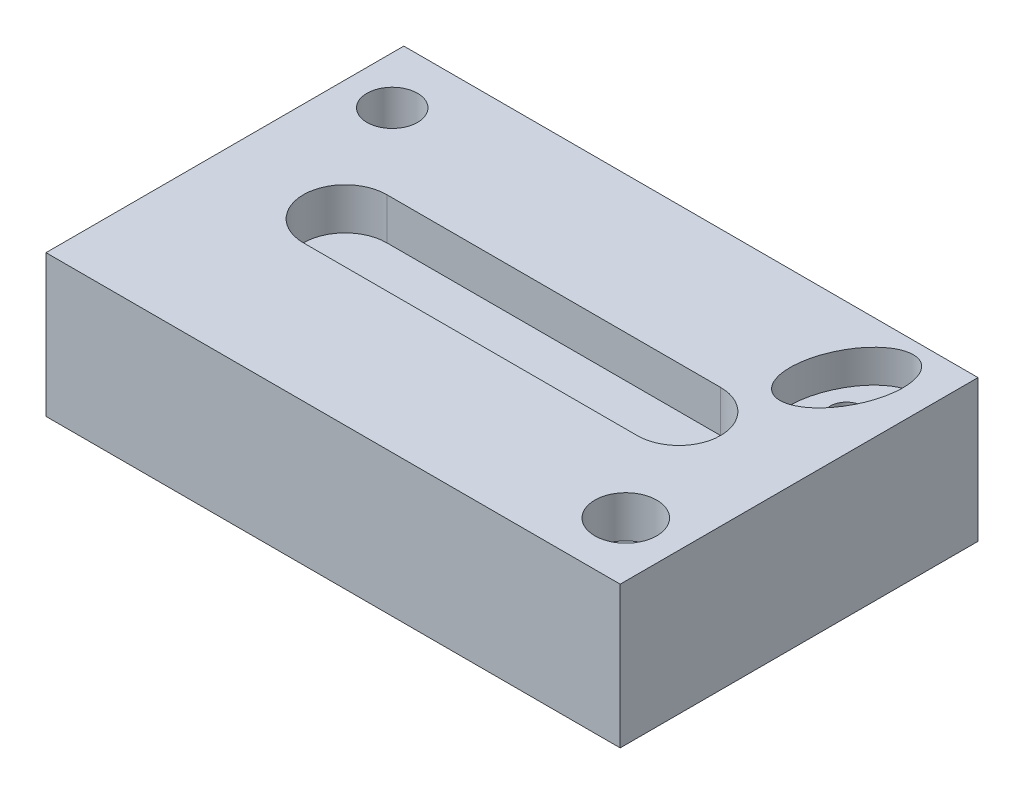
ISO-10303-21;
HEADER;
FILE_DESCRIPTION(('STEP AP214'),'2;1');
FILE_NAME('part.step','',(''),(''),'','','');
FILE_SCHEMA(('AUTOMOTIVE_DESIGN { 1 0 10303 214 1 1 1 1 }'));
ENDSEC;
DATA;
#1=APPLICATION_CONTEXT('core data for automotive mechanical design processes');
#2=APPLICATION_PROTOCOL_DEFINITION('international standard','automotive_design',2000,#1);
#3=PRODUCT_CONTEXT('',#1,'mechanical');
#4=PRODUCT('Part','Part','',(#3));
#5=PRODUCT_RELATED_PRODUCT_CATEGORY('part','',(#4));
#6=PRODUCT_DEFINITION_FORMATION('','',#4);
#7=PRODUCT_DEFINITION_CONTEXT('part definition',#1,'design');
#8=PRODUCT_DEFINITION('design','',#6,#7);
#9=PRODUCT_DEFINITION_SHAPE('','',#8);
#10=(LENGTH_UNIT() NAMED_UNIT(*) SI_UNIT(.MILLI.,.METRE.));
#11=(NAMED_UNIT(*) PLANE_ANGLE_UNIT() SI_UNIT($,.RADIAN.));
#12=(NAMED_UNIT(*) SI_UNIT($,.STERADIAN.) SOLID_ANGLE_UNIT());
#13=UNCERTAINTY_MEASURE_WITH_UNIT(LENGTH_MEASURE(1.E-05),#10,'distance_accuracy_value','');
#14=(GEOMETRIC_REPRESENTATION_CONTEXT(3) GLOBAL_UNCERTAINTY_ASSIGNED_CONTEXT((#13)) GLOBAL_UNIT_ASSIGNED_CONTEXT((#10,
#11,#12)) REPRESENTATION_CONTEXT('',''));
#15=CARTESIAN_POINT('',(0.,0.,0.));
#16=DIRECTION('',(0.,0.,1.));
#17=DIRECTION('',(1.,0.,0.));
#18=AXIS2_PLACEMENT_3D('',#15,#16,#17);
#19=CARTESIAN_POINT('',(87.39808345323,43.18,54.4636150551653));
#20=DIRECTION('',(-1.,0.,0.));
#21=DIRECTION('',(0.,0.,1.));
#22=AXIS2_PLACEMENT_3D('',#19,#20,#21);
#23=PLANE('',#22);
#24=DIRECTION('',(0.,0.,-1.));
#25=VECTOR('',#24,1.);
#26=CARTESIAN_POINT('',(87.39808345323,0.,54.4636150551653));
#27=LINE('',#26,#25);
#28=CARTESIAN_POINT('',(87.39808345323,0.,54.4636150551653));
#29=VERTEX_POINT('',#28);
#30=CARTESIAN_POINT('',(87.39808345323,0.,-54.4636150551653));
#31=VERTEX_POINT('',#30);
#32=EDGE_CURVE('E190',#29,#31,#27,.T.);
#33=ORIENTED_EDGE('',*,*,#32,.T.);
#34=DIRECTION('',(0.,-1.,0.));
#35=VECTOR('',#34,1.);
#36=CARTESIAN_POINT('',(87.39808345323,43.18,-54.4636150551653));
#37=LINE('',#36,#35);
#38=CARTESIAN_POINT('',(87.39808345323,43.18,-54.4636150551653));
#39=VERTEX_POINT('',#38);
#40=EDGE_CURVE('E12',#39,#31,#37,.T.);
#41=ORIENTED_EDGE('',*,*,#40,.F.);
#42=DIRECTION('',(0.,0.,-1.));
#43=VECTOR('',#42,1.);
#44=CARTESIAN_POINT('',(87.39808345323,43.18,54.4636150551653));
#45=LINE('',#44,#43);
#46=CARTESIAN_POINT('',(87.39808345323,43.18,54.4636150551653));
#47=VERTEX_POINT('',#46);
#48=EDGE_CURVE('E204',#47,#39,#45,.T.);
#49=ORIENTED_EDGE('',*,*,#48,.F.);
#50=DIRECTION('',(0.,-1.,0.));
#51=VECTOR('',#50,1.);
#52=CARTESIAN_POINT('',(87.39808345323,43.18,54.4636150551653));
#53=LINE('',#52,#51);
#54=EDGE_CURVE('E214',#47,#29,#53,.T.);
#55=ORIENTED_EDGE('',*,*,#54,.T.);
#56=EDGE_LOOP('',(#33,#41,#49,#55));
#57=FACE_BOUND('',#56,.T.);
#58=ADVANCED_FACE('F48',(#57),#23,.F.);
#59=CARTESIAN_POINT('',(-87.39808345323,43.18,-54.4636150551653));
#60=DIRECTION('',(0.,0.,1.));
#61=DIRECTION('',(1.,0.,0.));
#62=AXIS2_PLACEMENT_3D('',#59,#60,#61);
#63=PLANE('',#62);
#64=DIRECTION('',(-1.,0.,0.));
#65=VECTOR('',#64,1.);
#66=CARTESIAN_POINT('',(-87.39808345323,0.,-54.4636150551653));
#67=LINE('',#66,#65);
#68=CARTESIAN_POINT('',(-87.39808345323,0.,-54.4636150551653));
#69=VERTEX_POINT('',#68);
#70=EDGE_CURVE('E218',#31,#69,#67,.T.);
#71=ORIENTED_EDGE('',*,*,#70,.T.);
#72=DIRECTION('',(0.,-1.,0.));
#73=VECTOR('',#72,1.);
#74=CARTESIAN_POINT('',(-87.39808345323,43.18,-54.4636150551653));
#75=LINE('',#74,#73);
#76=CARTESIAN_POINT('',(-87.39808345323,43.18,-54.4636150551653));
#77=VERTEX_POINT('',#76);
#78=EDGE_CURVE('E56',#77,#69,#75,.T.);
#79=ORIENTED_EDGE('',*,*,#78,.F.);
#80=DIRECTION('',(-1.,0.,0.));
#81=VECTOR('',#80,1.);
#82=CARTESIAN_POINT('',(-87.39808345323,43.18,-54.4636150551653));
#83=LINE('',#82,#81);
#84=EDGE_CURVE('E100',#39,#77,#83,.T.);
#85=ORIENTED_EDGE('',*,*,#84,.F.);
#86=ORIENTED_EDGE('',*,*,#40,.T.);
#87=EDGE_LOOP('',(#71,#79,#85,#86));
#88=FACE_BOUND('',#87,.T.);
#89=ADVANCED_FACE('F253',(#88),#63,.F.);
#90=CARTESIAN_POINT('',(-87.39808345323,43.18,54.4636150551653));
#91=DIRECTION('',(1.,0.,0.));
#92=DIRECTION('',(0.,0.,-1.));
#93=AXIS2_PLACEMENT_3D('',#90,#91,#92);
#94=PLANE('',#93);
#95=DIRECTION('',(0.,0.,1.));
#96=VECTOR('',#95,1.);
#97=CARTESIAN_POINT('',(-87.39808345323,0.,54.4636150551653));
#98=LINE('',#97,#96);
#99=CARTESIAN_POINT('',(-87.39808345323,0.,54.4636150551653));
#100=VERTEX_POINT('',#99);
#101=EDGE_CURVE('E221',#69,#100,#98,.T.);
#102=ORIENTED_EDGE('',*,*,#101,.T.);
#103=DIRECTION('',(0.,-1.,0.));
#104=VECTOR('',#103,1.);
#105=CARTESIAN_POINT('',(-87.39808345323,43.18,54.4636150551653));
#106=LINE('',#105,#104);
#107=CARTESIAN_POINT('',(-87.39808345323,43.18,54.4636150551653));
#108=VERTEX_POINT('',#107);
#109=EDGE_CURVE('E228',#108,#100,#106,.T.);
#110=ORIENTED_EDGE('',*,*,#109,.F.);
#111=DIRECTION('',(0.,0.,1.));
#112=VECTOR('',#111,1.);
#113=CARTESIAN_POINT('',(-87.39808345323,43.18,54.4636150551653));
#114=LINE('',#113,#112);
#115=EDGE_CURVE('E209',#77,#108,#114,.T.);
#116=ORIENTED_EDGE('',*,*,#115,.F.);
#117=ORIENTED_EDGE('',*,*,#78,.T.);
#118=EDGE_LOOP('',(#102,#110,#116,#117));
#119=FACE_BOUND('',#118,.T.);
#120=ADVANCED_FACE('F235',(#119),#94,.F.);
#121=CARTESIAN_POINT('',(-87.39808345323,43.18,54.4636150551653));
#122=DIRECTION('',(0.,0.,-1.));
#123=DIRECTION('',(-1.,0.,0.));
#124=AXIS2_PLACEMENT_3D('',#121,#122,#123);
#125=PLANE('',#124);
#126=DIRECTION('',(1.,0.,0.));
#127=VECTOR('',#126,1.);
#128=CARTESIAN_POINT('',(-87.39808345323,0.,54.4636150551653));
#129=LINE('',#128,#127);
#130=EDGE_CURVE('E93',#100,#29,#129,.T.);
#131=ORIENTED_EDGE('',*,*,#130,.T.);
#132=ORIENTED_EDGE('',*,*,#54,.F.);
#133=DIRECTION('',(1.,0.,0.));
#134=VECTOR('',#133,1.);
#135=CARTESIAN_POINT('',(-87.39808345323,43.18,54.4636150551653));
#136=LINE('',#135,#134);
#137=EDGE_CURVE('E72',#108,#47,#136,.T.);
#138=ORIENTED_EDGE('',*,*,#137,.F.);
#139=ORIENTED_EDGE('',*,*,#109,.T.);
#140=EDGE_LOOP('',(#131,#132,#138,#139));
#141=FACE_BOUND('',#140,.T.);
#142=ADVANCED_FACE('F243',(#141),#125,.F.);
#143=CARTESIAN_POINT('',(0.,43.18,0.));
#144=DIRECTION('',(0.,-1.,0.));
#145=DIRECTION('',(0.,0.,-1.));
#146=AXIS2_PLACEMENT_3D('',#143,#144,#145);
#147=PLANE('',#146);
#148=CARTESIAN_POINT('',(67.39808345323,43.18,-34.4636150551653));
#149=DIRECTION('',(0.,1.,0.));
#150=DIRECTION('',(0.379556356256307,0.,-0.925168618374746));
#151=AXIS2_PLACEMENT_3D('',#148,#149,#150);
#152=ELLIPSE('',#151,17.,10.);
#153=CARTESIAN_POINT('',(73.8505415095872,43.18,-50.191481567536));
#154=VERTEX_POINT('',#153);
#155=EDGE_CURVE('E462',#154,#154,#152,.T.);
#156=ORIENTED_EDGE('',*,*,#155,.F.);
#157=EDGE_LOOP('',(#156));
#158=FACE_BOUND('',#157,.T.);
#159=CARTESIAN_POINT('',(70.8012631762642,43.18,36.1578333525472));
#160=DIRECTION('',(0.,1.,0.));
#161=DIRECTION('',(0.,0.,1.));
#162=AXIS2_PLACEMENT_3D('',#159,#160,#161);
#163=CIRCLE('',#162,9.43080752369951);
#164=CARTESIAN_POINT('',(70.8012631762642,43.18,45.5886408762467));
#165=VERTEX_POINT('',#164);
#166=EDGE_CURVE('E154',#165,#165,#163,.T.);
#167=ORIENTED_EDGE('',*,*,#166,.F.);
#168=EDGE_LOOP('',(#167));
#169=FACE_BOUND('',#168,.T.);
#170=CARTESIAN_POINT('',(-72.8740366318448,43.18,-36.4086310498237));
#171=DIRECTION('',(0.,1.,0.));
#172=DIRECTION('',(0.,0.,1.));
#173=AXIS2_PLACEMENT_3D('',#170,#171,#172);
#174=CIRCLE('',#173,7.69741318755806);
#175=CARTESIAN_POINT('',(-72.8740366318448,43.18,-28.7112178622657));
#176=VERTEX_POINT('',#175);
#177=EDGE_CURVE('E474',#176,#176,#174,.T.);
#178=ORIENTED_EDGE('',*,*,#177,.F.);
#179=EDGE_LOOP('',(#178));
#180=FACE_BOUND('',#179,.T.);
#181=DIRECTION('',(1.,0.,0.));
#182=VECTOR('',#181,1.);
#183=CARTESIAN_POINT('',(-50.8,43.18,12.7));
#184=LINE('',#183,#182);
#185=CARTESIAN_POINT('',(-50.8,43.18,12.7));
#186=VERTEX_POINT('',#185);
#187=CARTESIAN_POINT('',(50.8,43.18,12.7));
#188=VERTEX_POINT('',#187);
#189=EDGE_CURVE('E175',#186,#188,#184,.T.);
#190=ORIENTED_EDGE('',*,*,#189,.F.);
#191=CARTESIAN_POINT('',(-50.8,43.18,0.));
#192=DIRECTION('',(0.,1.,0.));
#193=DIRECTION('',(0.,0.,1.));
#194=AXIS2_PLACEMENT_3D('',#191,#192,#193);
#195=CIRCLE('',#194,12.7);
#196=CARTESIAN_POINT('',(-50.8,43.18,-12.7));
#197=VERTEX_POINT('',#196);
#198=EDGE_CURVE('E63',#197,#186,#195,.T.);
#199=ORIENTED_EDGE('',*,*,#198,.F.);
#200=DIRECTION('',(-1.,0.,0.));
#201=VECTOR('',#200,1.);
#202=CARTESIAN_POINT('',(-50.8,43.18,-12.7));
#203=LINE('',#202,#201);
#204=CARTESIAN_POINT('',(50.8,43.18,-12.7));
#205=VERTEX_POINT('',#204);
#206=EDGE_CURVE('E146',#205,#197,#203,.T.);
#207=ORIENTED_EDGE('',*,*,#206,.F.);
#208=CARTESIAN_POINT('',(50.8,43.18,0.));
#209=DIRECTION('',(0.,1.,0.));
#210=DIRECTION('',(0.,0.,1.));
#211=AXIS2_PLACEMENT_3D('',#208,#209,#210);
#212=CIRCLE('',#211,12.7);
#213=EDGE_CURVE('E150',#188,#205,#212,.T.);
#214=ORIENTED_EDGE('',*,*,#213,.F.);
#215=EDGE_LOOP('',(#190,#199,#207,#214));
#216=FACE_BOUND('',#215,.T.);
#217=ORIENTED_EDGE('',*,*,#48,.T.);
#218=ORIENTED_EDGE('',*,*,#84,.T.);
#219=ORIENTED_EDGE('',*,*,#115,.T.);
#220=ORIENTED_EDGE('',*,*,#137,.T.);
#221=EDGE_LOOP('',(#217,#218,#219,#220));
#222=FACE_BOUND('',#221,.T.);
#223=ADVANCED_FACE('F245',(#158,#169,#180,#216,#222),#147,.F.);
#224=CARTESIAN_POINT('',(0.,0.,0.));
#225=DIRECTION('',(0.,-1.,0.));
#226=DIRECTION('',(0.,0.,-1.));
#227=AXIS2_PLACEMENT_3D('',#224,#225,#226);
#228=PLANE('',#227);
#229=CARTESIAN_POINT('',(67.39808345323,0.,-34.4636150551653));
#230=DIRECTION('',(0.,-1.,0.));
#231=DIRECTION('',(0.,0.,-1.));
#232=AXIS2_PLACEMENT_3D('',#229,#230,#231);
#233=CIRCLE('',#232,5.00000000000001);
#234=CARTESIAN_POINT('',(67.39808345323,0.,-39.4636150551653));
#235=VERTEX_POINT('',#234);
#236=EDGE_CURVE('E463',#235,#235,#233,.T.);
#237=ORIENTED_EDGE('',*,*,#236,.F.);
#238=EDGE_LOOP('',(#237));
#239=FACE_BOUND('',#238,.T.);
#240=ORIENTED_EDGE('',*,*,#32,.F.);
#241=ORIENTED_EDGE('',*,*,#130,.F.);
#242=ORIENTED_EDGE('',*,*,#101,.F.);
#243=ORIENTED_EDGE('',*,*,#70,.F.);
#244=EDGE_LOOP('',(#240,#241,#242,#243));
#245=FACE_BOUND('',#244,.T.);
#246=ADVANCED_FACE('F239',(#239,#245),#228,.T.);
#247=CARTESIAN_POINT('',(-50.8,30.48,0.));
#248=DIRECTION('',(0.,1.,0.));
#249=DIRECTION('',(0.,0.,1.));
#250=AXIS2_PLACEMENT_3D('',#247,#248,#249);
#251=CYLINDRICAL_SURFACE('',#250,12.7);
#252=ORIENTED_EDGE('',*,*,#198,.T.);
#253=DIRECTION('',(0.,1.,0.));
#254=VECTOR('',#253,1.);
#255=CARTESIAN_POINT('',(-50.8,30.48,12.7));
#256=LINE('',#255,#254);
#257=CARTESIAN_POINT('',(-50.8,30.48,12.7));
#258=VERTEX_POINT('',#257);
#259=EDGE_CURVE('E120',#258,#186,#256,.T.);
#260=ORIENTED_EDGE('',*,*,#259,.F.);
#261=CARTESIAN_POINT('',(-50.8,30.48,0.));
#262=DIRECTION('',(0.,1.,0.));
#263=DIRECTION('',(0.,0.,1.));
#264=AXIS2_PLACEMENT_3D('',#261,#262,#263);
#265=CIRCLE('',#264,12.7);
#266=CARTESIAN_POINT('',(-50.8,30.48,-12.7));
#267=VERTEX_POINT('',#266);
#268=EDGE_CURVE('E124',#267,#258,#265,.T.);
#269=ORIENTED_EDGE('',*,*,#268,.F.);
#270=DIRECTION('',(0.,1.,0.));
#271=VECTOR('',#270,1.);
#272=CARTESIAN_POINT('',(-50.8,30.48,-12.7));
#273=LINE('',#272,#271);
#274=EDGE_CURVE('E186',#267,#197,#273,.T.);
#275=ORIENTED_EDGE('',*,*,#274,.T.);
#276=EDGE_LOOP('',(#252,#260,#269,#275));
#277=FACE_BOUND('',#276,.T.);
#278=ADVANCED_FACE('F122',(#277),#251,.F.);
#279=CARTESIAN_POINT('',(-50.8,30.48,-12.7));
#280=DIRECTION('',(0.,0.,-1.));
#281=DIRECTION('',(-1.,0.,0.));
#282=AXIS2_PLACEMENT_3D('',#279,#280,#281);
#283=PLANE('',#282);
#284=ORIENTED_EDGE('',*,*,#206,.T.);
#285=ORIENTED_EDGE('',*,*,#274,.F.);
#286=DIRECTION('',(-1.,0.,0.));
#287=VECTOR('',#286,1.);
#288=CARTESIAN_POINT('',(-50.8,30.48,-12.7));
#289=LINE('',#288,#287);
#290=CARTESIAN_POINT('',(50.8,30.48,-12.7));
#291=VERTEX_POINT('',#290);
#292=EDGE_CURVE('E131',#291,#267,#289,.T.);
#293=ORIENTED_EDGE('',*,*,#292,.F.);
#294=DIRECTION('',(0.,1.,0.));
#295=VECTOR('',#294,1.);
#296=CARTESIAN_POINT('',(50.8,30.48,-12.7));
#297=LINE('',#296,#295);
#298=EDGE_CURVE('E191',#291,#205,#297,.T.);
#299=ORIENTED_EDGE('',*,*,#298,.T.);
#300=EDGE_LOOP('',(#284,#285,#293,#299));
#301=FACE_BOUND('',#300,.T.);
#302=ADVANCED_FACE('F294',(#301),#283,.F.);
#303=CARTESIAN_POINT('',(50.8,30.48,0.));
#304=DIRECTION('',(0.,1.,0.));
#305=DIRECTION('',(0.,0.,1.));
#306=AXIS2_PLACEMENT_3D('',#303,#304,#305);
#307=CYLINDRICAL_SURFACE('',#306,12.7);
#308=ORIENTED_EDGE('',*,*,#213,.T.);
#309=ORIENTED_EDGE('',*,*,#298,.F.);
#310=CARTESIAN_POINT('',(50.8,30.48,0.));
#311=DIRECTION('',(0.,1.,0.));
#312=DIRECTION('',(0.,0.,1.));
#313=AXIS2_PLACEMENT_3D('',#310,#311,#312);
#314=CIRCLE('',#313,12.7);
#315=CARTESIAN_POINT('',(50.8,30.48,12.7));
#316=VERTEX_POINT('',#315);
#317=EDGE_CURVE('E140',#316,#291,#314,.T.);
#318=ORIENTED_EDGE('',*,*,#317,.F.);
#319=DIRECTION('',(0.,1.,0.));
#320=VECTOR('',#319,1.);
#321=CARTESIAN_POINT('',(50.8,30.48,12.7));
#322=LINE('',#321,#320);
#323=EDGE_CURVE('E130',#316,#188,#322,.T.);
#324=ORIENTED_EDGE('',*,*,#323,.T.);
#325=EDGE_LOOP('',(#308,#309,#318,#324));
#326=FACE_BOUND('',#325,.T.);
#327=ADVANCED_FACE('F302',(#326),#307,.F.);
#328=CARTESIAN_POINT('',(-50.8,30.48,12.7));
#329=DIRECTION('',(0.,0.,1.));
#330=DIRECTION('',(1.,0.,0.));
#331=AXIS2_PLACEMENT_3D('',#328,#329,#330);
#332=PLANE('',#331);
#333=ORIENTED_EDGE('',*,*,#189,.T.);
#334=ORIENTED_EDGE('',*,*,#323,.F.);
#335=DIRECTION('',(1.,0.,0.));
#336=VECTOR('',#335,1.);
#337=CARTESIAN_POINT('',(-50.8,30.48,12.7));
#338=LINE('',#337,#336);
#339=EDGE_CURVE('E134',#258,#316,#338,.T.);
#340=ORIENTED_EDGE('',*,*,#339,.F.);
#341=ORIENTED_EDGE('',*,*,#259,.T.);
#342=EDGE_LOOP('',(#333,#334,#340,#341));
#343=FACE_BOUND('',#342,.T.);
#344=ADVANCED_FACE('F135',(#343),#332,.F.);
#345=CARTESIAN_POINT('',(-50.8,30.48,0.));
#346=DIRECTION('',(0.,1.,0.));
#347=DIRECTION('',(0.,0.,1.));
#348=AXIS2_PLACEMENT_3D('',#345,#346,#347);
#349=PLANE('',#348);
#350=ORIENTED_EDGE('',*,*,#268,.T.);
#351=ORIENTED_EDGE('',*,*,#339,.T.);
#352=ORIENTED_EDGE('',*,*,#317,.T.);
#353=ORIENTED_EDGE('',*,*,#292,.T.);
#354=EDGE_LOOP('',(#350,#351,#352,#353));
#355=FACE_BOUND('',#354,.T.);
#356=ADVANCED_FACE('F143',(#355),#349,.T.);
#357=CARTESIAN_POINT('',(-72.8740366318448,30.48,-36.4086310498237));
#358=DIRECTION('',(0.,1.,0.));
#359=DIRECTION('',(0.,0.,1.));
#360=AXIS2_PLACEMENT_3D('',#357,#358,#359);
#361=CYLINDRICAL_SURFACE('',#360,7.69741318755806);
#362=CARTESIAN_POINT('',(-72.8740366318448,30.48,-36.4086310498237));
#363=DIRECTION('',(0.,1.,0.));
#364=DIRECTION('',(0.,0.,1.));
#365=AXIS2_PLACEMENT_3D('',#362,#363,#364);
#366=CIRCLE('',#365,7.69741318755806);
#367=CARTESIAN_POINT('',(-72.8740366318448,30.48,-28.7112178622657));
#368=VERTEX_POINT('',#367);
#369=EDGE_CURVE('E176',#368,#368,#366,.T.);
#370=ORIENTED_EDGE('',*,*,#369,.F.);
#371=EDGE_LOOP('',(#370));
#372=FACE_BOUND('',#371,.T.);
#373=ORIENTED_EDGE('',*,*,#177,.T.);
#374=EDGE_LOOP('',(#373));
#375=FACE_BOUND('',#374,.T.);
#376=ADVANCED_FACE('F324',(#372,#375),#361,.F.);
#377=CARTESIAN_POINT('',(-72.8740366318448,30.48,-36.4086310498237));
#378=DIRECTION('',(0.,1.,0.));
#379=DIRECTION('',(0.,0.,1.));
#380=AXIS2_PLACEMENT_3D('',#377,#378,#379);
#381=PLANE('',#380);
#382=ORIENTED_EDGE('',*,*,#369,.T.);
#383=EDGE_LOOP('',(#382));
#384=FACE_BOUND('',#383,.T.);
#385=ADVANCED_FACE('F333',(#384),#381,.T.);
#386=CARTESIAN_POINT('',(70.8012631762642,30.48,36.1578333525472));
#387=DIRECTION('',(0.,1.,0.));
#388=DIRECTION('',(0.,0.,1.));
#389=AXIS2_PLACEMENT_3D('',#386,#387,#388);
#390=CYLINDRICAL_SURFACE('',#389,9.43080752369951);
#391=CARTESIAN_POINT('',(70.8012631762642,30.48,36.1578333525472));
#392=DIRECTION('',(0.,1.,0.));
#393=DIRECTION('',(0.,0.,1.));
#394=AXIS2_PLACEMENT_3D('',#391,#392,#393);
#395=CIRCLE('',#394,9.43080752369951);
#396=CARTESIAN_POINT('',(70.8012631762642,30.48,45.5886408762467));
#397=VERTEX_POINT('',#396);
#398=EDGE_CURVE('E479',#397,#397,#395,.T.);
#399=ORIENTED_EDGE('',*,*,#398,.F.);
#400=EDGE_LOOP('',(#399));
#401=FACE_BOUND('',#400,.T.);
#402=ORIENTED_EDGE('',*,*,#166,.T.);
#403=EDGE_LOOP('',(#402));
#404=FACE_BOUND('',#403,.T.);
#405=ADVANCED_FACE('F343',(#401,#404),#390,.F.);
#406=CARTESIAN_POINT('',(70.8012631762642,30.48,36.1578333525472));
#407=DIRECTION('',(0.,1.,0.));
#408=DIRECTION('',(0.,0.,1.));
#409=AXIS2_PLACEMENT_3D('',#406,#407,#408);
#410=PLANE('',#409);
#411=ORIENTED_EDGE('',*,*,#398,.T.);
#412=EDGE_LOOP('',(#411));
#413=FACE_BOUND('',#412,.T.);
#414=ADVANCED_FACE('F351',(#413),#410,.T.);
#415=CARTESIAN_POINT('',(67.39808345323,33.18,-34.4636150551653));
#416=DIRECTION('',(0.,1.,0.));
#417=DIRECTION('',(0.379556356256307,0.,-0.925168618374746));
#418=AXIS2_PLACEMENT_3D('',#415,#416,#417);
#419=ELLIPSE('',#418,17.,10.);
#420=DIRECTION('',(0.,1.,0.));
#421=VECTOR('',#420,1.);
#422=SURFACE_OF_LINEAR_EXTRUSION('',#419,#421);
#423=CARTESIAN_POINT('',(73.8505415095872,33.18,-50.191481567536));
#424=VERTEX_POINT('',#423);
#425=EDGE_CURVE('E456',#424,#424,#419,.T.);
#426=ORIENTED_EDGE('',*,*,#425,.F.);
#427=EDGE_LOOP('',(#426));
#428=FACE_BOUND('',#427,.T.);
#429=ORIENTED_EDGE('',*,*,#155,.T.);
#430=EDGE_LOOP('',(#429));
#431=FACE_BOUND('',#430,.T.);
#432=ADVANCED_FACE('F359',(#428,#431),#422,.F.);
#433=CARTESIAN_POINT('',(67.39808345323,33.18,-34.4636150551653));
#434=DIRECTION('',(0.,1.,0.));
#435=DIRECTION('',(0.,0.,1.));
#436=AXIS2_PLACEMENT_3D('',#433,#434,#435);
#437=PLANE('',#436);
#438=CARTESIAN_POINT('',(67.39808345323,33.18,-34.4636150551653));
#439=DIRECTION('',(0.,1.,0.));
#440=DIRECTION('',(0.,0.,1.));
#441=AXIS2_PLACEMENT_3D('',#438,#439,#440);
#442=CIRCLE('',#441,5.00000000000001);
#443=CARTESIAN_POINT('',(67.39808345323,33.18,-29.4636150551653));
#444=VERTEX_POINT('',#443);
#445=EDGE_CURVE('E501',#444,#444,#442,.T.);
#446=ORIENTED_EDGE('',*,*,#445,.F.);
#447=EDGE_LOOP('',(#446));
#448=FACE_BOUND('',#447,.T.);
#449=ORIENTED_EDGE('',*,*,#425,.T.);
#450=EDGE_LOOP('',(#449));
#451=FACE_BOUND('',#450,.T.);
#452=ADVANCED_FACE('F367',(#448,#451),#437,.T.);
#453=CARTESIAN_POINT('',(67.39808345323,-16.82,-34.4636150551653));
#454=DIRECTION('',(0.,1.,0.));
#455=DIRECTION('',(0.,0.,1.));
#456=AXIS2_PLACEMENT_3D('',#453,#454,#455);
#457=CYLINDRICAL_SURFACE('',#456,5.00000000000001);
#458=ORIENTED_EDGE('',*,*,#236,.T.);
#459=EDGE_LOOP('',(#458));
#460=FACE_BOUND('',#459,.T.);
#461=ORIENTED_EDGE('',*,*,#445,.T.);
#462=EDGE_LOOP('',(#461));
#463=FACE_BOUND('',#462,.T.);
#464=ADVANCED_FACE('F376',(#460,#463),#457,.F.);
#465=CLOSED_SHELL('',(#58,#89,#120,#142,#223,#246,#278,#302,#327,#344,#356,#376,#385,#405,#414,
#432,#452,#464));
#466=MANIFOLD_SOLID_BREP('B2',#465);
#467=ADVANCED_BREP_SHAPE_REPRESENTATION('',(#18,#466),#14);
#468=SHAPE_DEFINITION_REPRESENTATION(#9,#467);
ENDSEC;
END-ISO-10303-21;
